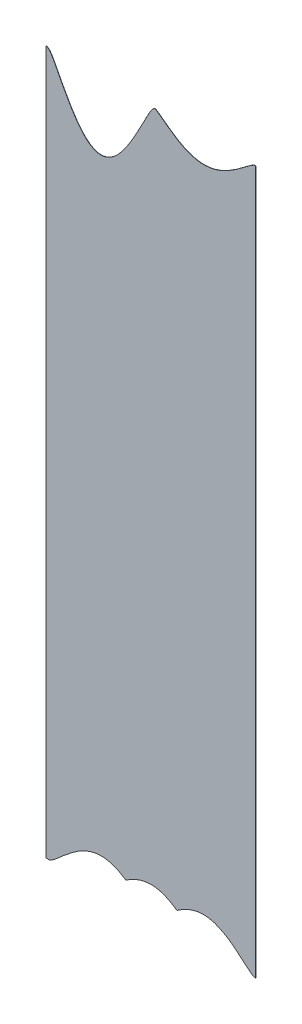
ISO-10303-21;
HEADER;
FILE_DESCRIPTION(('STEP AP214'),'2;1');
FILE_NAME('part.step','',(''),(''),'','','');
FILE_SCHEMA(('AUTOMOTIVE_DESIGN { 1 0 10303 214 1 1 1 1 }'));
ENDSEC;
DATA;
#1=APPLICATION_CONTEXT('core data for automotive mechanical design processes');
#2=APPLICATION_PROTOCOL_DEFINITION('international standard','automotive_design',2000,#1);
#3=PRODUCT_CONTEXT('',#1,'mechanical');
#4=PRODUCT('Part','Part','',(#3));
#5=PRODUCT_RELATED_PRODUCT_CATEGORY('part','',(#4));
#6=PRODUCT_DEFINITION_FORMATION('','',#4);
#7=PRODUCT_DEFINITION_CONTEXT('part definition',#1,'design');
#8=PRODUCT_DEFINITION('design','',#6,#7);
#9=PRODUCT_DEFINITION_SHAPE('','',#8);
#10=(LENGTH_UNIT() NAMED_UNIT(*) SI_UNIT(.MILLI.,.METRE.));
#11=(NAMED_UNIT(*) PLANE_ANGLE_UNIT() SI_UNIT($,.RADIAN.));
#12=(NAMED_UNIT(*) SI_UNIT($,.STERADIAN.) SOLID_ANGLE_UNIT());
#13=UNCERTAINTY_MEASURE_WITH_UNIT(LENGTH_MEASURE(1.E-05),#10,'distance_accuracy_value','');
#14=(GEOMETRIC_REPRESENTATION_CONTEXT(3) GLOBAL_UNCERTAINTY_ASSIGNED_CONTEXT((#13)) GLOBAL_UNIT_ASSIGNED_CONTEXT((#10,
#11,#12)) REPRESENTATION_CONTEXT('',''));
#15=CARTESIAN_POINT('',(0.,0.,0.));
#16=DIRECTION('',(0.,0.,1.));
#17=DIRECTION('',(1.,0.,0.));
#18=AXIS2_PLACEMENT_3D('',#15,#16,#17);
#19=CARTESIAN_POINT('',(77.4248337125186,269.090560042543,192.698226624831));
#20=CARTESIAN_POINT('',(77.209531905466,269.029841929501,192.699081003808));
#21=CARTESIAN_POINT('',(77.0031450020932,269.023383046287,192.699900005905));
#22=B_SPLINE_CURVE_WITH_KNOTS('',2,(#19,#20,#21),.UNSPECIFIED.,.F.,.F.,(3,3),(0.,1.),.UNSPECIFIED.);
#23=DIRECTION('',(-0.00396825396825352,0.,-0.999992126449225));
#24=VECTOR('',#23,1.);
#25=SURFACE_OF_LINEAR_EXTRUSION('',#22,#24);
#26=CARTESIAN_POINT('',(77.4244368871217,269.090560042543,192.598227412186));
#27=CARTESIAN_POINT('',(77.2091350800692,269.029841929501,192.599081791163));
#28=CARTESIAN_POINT('',(77.0027481766964,269.023383046287,192.59990079326));
#29=B_SPLINE_CURVE_WITH_KNOTS('',2,(#26,#27,#28),.UNSPECIFIED.,.F.,.F.,(3,3),(0.,1.),.UNSPECIFIED.);
#30=CARTESIAN_POINT('',(77.4244378112385,269.09055978193,192.598227408519));
#31=VERTEX_POINT('',#30);
#32=CARTESIAN_POINT('',(77.0027481766964,269.023383046287,192.59990079326));
#33=VERTEX_POINT('',#32);
#34=EDGE_CURVE('E212',#31,#33,#29,.T.);
#35=ORIENTED_EDGE('',*,*,#34,.F.);
#36=DIRECTION('',(-0.00396825396825352,0.,-0.999992126449225));
#37=VECTOR('',#36,1.);
#38=CARTESIAN_POINT('',(77.4248346366353,269.09055978193,192.698226621164));
#39=LINE('',#38,#37);
#40=CARTESIAN_POINT('',(77.4248346366353,269.09055978193,192.698226621164));
#41=VERTEX_POINT('',#40);
#42=EDGE_CURVE('E267',#41,#31,#39,.T.);
#43=ORIENTED_EDGE('',*,*,#42,.F.);
#44=CARTESIAN_POINT('',(77.0031450020932,269.023383046287,192.699900005905));
#45=VERTEX_POINT('',#44);
#46=EDGE_CURVE('E216',#41,#45,#22,.T.);
#47=ORIENTED_EDGE('',*,*,#46,.T.);
#48=DIRECTION('',(-0.00396825396825352,0.,-0.999992126449225));
#49=VECTOR('',#48,1.);
#50=CARTESIAN_POINT('',(77.0031450020932,269.023383046287,192.699900005905));
#51=LINE('',#50,#49);
#52=EDGE_CURVE('E13',#45,#33,#51,.T.);
#53=ORIENTED_EDGE('',*,*,#52,.T.);
#54=EDGE_LOOP('',(#35,#43,#47,#53));
#55=FACE_BOUND('',#54,.T.);
#56=ADVANCED_FACE('F45',(#55),#25,.T.);
#57=CARTESIAN_POINT('',(77.0031450020933,269.023383046284,192.699900005905));
#58=DIRECTION('',(0.999992126449225,0.,-0.00396825396825352));
#59=DIRECTION('',(0.00396825396825352,0.,0.999992126449225));
#60=AXIS2_PLACEMENT_3D('',#57,#58,#59);
#61=PLANE('',#60);
#62=DIRECTION('',(0.,1.,0.));
#63=VECTOR('',#62,1.);
#64=CARTESIAN_POINT('',(77.0027481766965,269.023383046284,192.59990079326));
#65=LINE('',#64,#63);
#66=CARTESIAN_POINT('',(77.0027481766964,536.798762383789,192.59990079326));
#67=VERTEX_POINT('',#66);
#68=EDGE_CURVE('E207',#33,#67,#65,.T.);
#69=ORIENTED_EDGE('',*,*,#68,.F.);
#70=ORIENTED_EDGE('',*,*,#52,.F.);
#71=DIRECTION('',(0.,1.,0.));
#72=VECTOR('',#71,1.);
#73=CARTESIAN_POINT('',(77.0031450020933,269.023383046284,192.699900005905));
#74=LINE('',#73,#72);
#75=CARTESIAN_POINT('',(77.0031450020932,536.798762383789,192.699900005905));
#76=VERTEX_POINT('',#75);
#77=EDGE_CURVE('E103',#45,#76,#74,.T.);
#78=ORIENTED_EDGE('',*,*,#77,.T.);
#79=DIRECTION('',(-0.00396825396825352,0.,-0.999992126449225));
#80=VECTOR('',#79,1.);
#81=CARTESIAN_POINT('',(77.0031450020932,536.798762383789,192.699900005905));
#82=LINE('',#81,#80);
#83=EDGE_CURVE('E54',#76,#67,#82,.T.);
#84=ORIENTED_EDGE('',*,*,#83,.T.);
#85=EDGE_LOOP('',(#69,#70,#78,#84));
#86=FACE_BOUND('',#85,.T.);
#87=ADVANCED_FACE('F197',(#86),#61,.F.);
#88=CARTESIAN_POINT('',(77.0031450020932,536.798762383789,192.699900005905));
#89=CARTESIAN_POINT('',(77.2661233072099,536.745601889857,192.698856432986));
#90=CARTESIAN_POINT('',(77.7241891403564,536.504886026703,192.697038697114));
#91=CARTESIAN_POINT('',(78.1225200868348,536.157177914668,192.695458006309));
#92=CARTESIAN_POINT('',(78.4699339120561,535.752648616193,192.694079369163));
#93=CARTESIAN_POINT('',(78.9033271113471,535.152786487229,192.692359541339));
#94=CARTESIAN_POINT('',(79.2170173776124,534.63292863615,192.691114728894));
#95=CARTESIAN_POINT('',(79.4561923109163,534.236560051497,192.690165614543));
#96=CARTESIAN_POINT('',(79.7442402813425,533.717596674628,192.689022558042));
#97=CARTESIAN_POINT('',(80.1428905244522,532.999366040864,192.687440600177));
#98=CARTESIAN_POINT('',(80.7402656251471,531.851921506764,192.685070045398));
#99=CARTESIAN_POINT('',(80.9454110452979,531.457875971932,192.684255969861));
#100=CARTESIAN_POINT('',(81.2253546543758,530.914886505265,192.683145073777));
#101=CARTESIAN_POINT('',(81.3511863839341,530.670818409025,192.682645737585));
#102=CARTESIAN_POINT('',(81.7074309720887,529.978334175992,192.681232057454));
#103=CARTESIAN_POINT('',(82.315394194015,528.796547955386,192.67881948599));
#104=CARTESIAN_POINT('',(82.6721967104483,528.110242036952,192.677403591841));
#105=CARTESIAN_POINT('',(83.1982487109191,527.098386501474,192.675316067466));
#106=CARTESIAN_POINT('',(83.6490694057289,526.25242367581,192.673527082369));
#107=CARTESIAN_POINT('',(84.7385225882531,524.208070115014,192.669203821415));
#108=CARTESIAN_POINT('',(85.6843286261529,522.57928036476,192.665450593301));
#109=CARTESIAN_POINT('',(86.8466121731742,520.577690765606,192.660838320688));
#110=CARTESIAN_POINT('',(87.9162297471326,518.985432515547,192.656593773086));
#111=CARTESIAN_POINT('',(89.2203980683777,517.044016424857,192.651418461222));
#112=CARTESIAN_POINT('',(90.4502154436802,515.615389030759,192.646538195117));
#113=CARTESIAN_POINT('',(91.1867844090042,514.759747678931,192.643615279384));
#114=CARTESIAN_POINT('',(91.9064459981967,514.07578364902,192.640759456941));
#115=CARTESIAN_POINT('',(92.735591316979,513.287766639173,192.637469171833));
#116=CARTESIAN_POINT('',(93.5491456678006,512.721153308884,192.634240756133));
#117=CARTESIAN_POINT('',(94.4904030548573,512.065599095202,192.630505578363));
#118=CARTESIAN_POINT('',(95.4190129942719,511.700757369727,192.626820589272));
#119=CARTESIAN_POINT('',(96.4704804987367,511.287646113508,192.622648066322));
#120=CARTESIAN_POINT('',(98.5755541764351,511.198598646507,192.614294533575));
#121=CARTESIAN_POINT('',(99.6392356365664,511.532507188992,192.610073542166));
#122=CARTESIAN_POINT('',(100.604163314002,511.8354151614,192.606244433932));
#123=CARTESIAN_POINT('',(101.580816687193,512.452586730697,192.602368794793));
#124=CARTESIAN_POINT('',(102.423018591509,512.984795071158,192.59902669743));
#125=CARTESIAN_POINT('',(103.280510134128,513.754779501639,192.595623926422));
#126=CARTESIAN_POINT('',(104.023955021638,514.422355751494,192.592673725068));
#127=CARTESIAN_POINT('',(104.784323840767,515.273514184056,192.589656364727));
#128=CARTESIAN_POINT('',(106.050228275655,516.690570232997,192.584632894877));
#129=CARTESIAN_POINT('',(107.391100121666,518.6506320657,192.579311932958));
#130=CARTESIAN_POINT('',(108.476670182567,520.237498438819,192.575004081338));
#131=CARTESIAN_POINT('',(109.653034416638,522.241955314544,192.570335932544));
#132=CARTESIAN_POINT('',(110.616669290892,523.883933618067,192.566511954522));
#133=CARTESIAN_POINT('',(111.718310313976,525.940076863676,192.56214032874));
#134=CARTESIAN_POINT('',(112.180237750085,526.802235187318,192.560307268926));
#135=CARTESIAN_POINT('',(112.710903316909,527.81988857811,192.558201436604));
#136=CARTESIAN_POINT('',(113.142966561622,528.648453032841,192.556486886419));
#137=CARTESIAN_POINT('',(113.93412269219,530.187170989474,192.553347353245));
#138=CARTESIAN_POINT('',(114.467358280453,531.222717301503,192.551231322345));
#139=CARTESIAN_POINT('',(114.666956735831,531.607438778925,192.550439258746));
#140=CARTESIAN_POINT('',(115.269967026661,532.769727382564,192.548046341926));
#141=CARTESIAN_POINT('',(115.665226981358,533.491221460733,192.546477837693));
#142=CARTESIAN_POINT('',(115.952331014527,534.015291398223,192.545338527003));
#143=CARTESIAN_POINT('',(116.189986174152,534.419245477904,192.544395443548));
#144=CARTESIAN_POINT('',(116.498677479085,534.943943162511,192.543170468407));
#145=CARTESIAN_POINT('',(116.919501763995,535.559437999124,192.54150051762));
#146=CARTESIAN_POINT('',(117.250759512005,535.980822727626,192.540185992397));
#147=CARTESIAN_POINT('',(117.625695647593,536.360192484867,192.538698138874));
#148=CARTESIAN_POINT('',(118.058114314527,536.655506954392,192.536982178273));
#149=CARTESIAN_POINT('',(118.304909703597,536.738353144728,192.53600282378));
#150=B_SPLINE_CURVE_WITH_KNOTS('',2,(#88,#89,#90,#91,#92,#93,#94,#95,#96,#97,#98,#99,#100,#101,
#102,#103,#104,#105,#106,#107,#108,#109,#110,#111,#112,#113,#114,#115,#116,#117,#118,#119,#120,
#121,#122,#123,#124,#125,#126,#127,#128,#129,#130,#131,#132,#133,#134,#135,#136,#137,#138,#139,
#140,#141,#142,#143,#144,#145,#146,#147,#148,#149),.UNSPECIFIED.,.F.,.F.,(3,1,1,1,1,2,2,2,2,2,2,
2,2,2,2,2,2,2,1,2,2,2,2,2,2,2,2,1,1,2,2,2,1,1,1,1,3),(0.,0.0078125,0.015625,0.0234375,0.03125,
0.046875,0.0625,0.09375,0.109375,0.125,0.15625,0.1875,0.25,0.3125,0.375,0.40625,0.4375,0.46875,
0.5,0.53125,0.5625,0.59375,0.625,0.6875,0.75,0.8125,0.84375,0.875,0.890625,0.90625,0.9375,
0.953125,0.96875,0.9765625,0.984375,0.9921875,1.),.UNSPECIFIED.);
#151=DIRECTION('',(-0.00396825396825352,0.,-0.999992126449225));
#152=VECTOR('',#151,1.);
#153=SURFACE_OF_LINEAR_EXTRUSION('',#150,#152);
#154=CARTESIAN_POINT('',(77.0027481766964,536.798762383789,192.59990079326));
#155=CARTESIAN_POINT('',(77.2657264818131,536.745601889857,192.598857220341));
#156=CARTESIAN_POINT('',(77.7237923149596,536.504886026703,192.597039484469));
#157=CARTESIAN_POINT('',(78.122123261438,536.157177914668,192.595458793664));
#158=CARTESIAN_POINT('',(78.4695370866593,535.752648616193,192.594080156519));
#159=CARTESIAN_POINT('',(78.9029302859503,535.152786487229,192.592360328694));
#160=CARTESIAN_POINT('',(79.2166205522156,534.63292863615,192.591115516249));
#161=CARTESIAN_POINT('',(79.4557954855195,534.236560051497,192.590166401898));
#162=CARTESIAN_POINT('',(79.7438434559457,533.717596674628,192.589023345397));
#163=CARTESIAN_POINT('',(80.1424936990554,532.999366040864,192.587441387532));
#164=CARTESIAN_POINT('',(80.7398687997503,531.851921506764,192.585070832753));
#165=CARTESIAN_POINT('',(80.9450142199011,531.457875971932,192.584256757216));
#166=CARTESIAN_POINT('',(81.224957828979,530.914886505265,192.583145861132));
#167=CARTESIAN_POINT('',(81.3507895585373,530.670818409025,192.58264652494));
#168=CARTESIAN_POINT('',(81.7070341466919,529.978334175992,192.581232844809));
#169=CARTESIAN_POINT('',(82.3149973686181,528.796547955386,192.578820273345));
#170=CARTESIAN_POINT('',(82.6717998850515,528.110242036952,192.577404379196));
#171=CARTESIAN_POINT('',(83.1978518855223,527.098386501474,192.575316854821));
#172=CARTESIAN_POINT('',(83.648672580332,526.25242367581,192.573527869724));
#173=CARTESIAN_POINT('',(84.7381257628563,524.208070115014,192.56920460877));
#174=CARTESIAN_POINT('',(85.6839318007561,522.57928036476,192.565451380656));
#175=CARTESIAN_POINT('',(86.8462153477774,520.577690765606,192.560839108043));
#176=CARTESIAN_POINT('',(87.9158329217358,518.985432515547,192.556594560441));
#177=CARTESIAN_POINT('',(89.2200012429809,517.044016424857,192.551419248577));
#178=CARTESIAN_POINT('',(90.4498186182834,515.615389030759,192.546538982472));
#179=CARTESIAN_POINT('',(91.1863875836074,514.759747678931,192.543616066739));
#180=CARTESIAN_POINT('',(91.9060491727999,514.07578364902,192.540760244296));
#181=CARTESIAN_POINT('',(92.7351944915822,513.287766639173,192.537469959188));
#182=CARTESIAN_POINT('',(93.5487488424038,512.721153308884,192.534241543488));
#183=CARTESIAN_POINT('',(94.4900062294605,512.065599095202,192.530506365718));
#184=CARTESIAN_POINT('',(95.418616168875,511.700757369727,192.526821376627));
#185=CARTESIAN_POINT('',(96.4700836733399,511.287646113508,192.522648853677));
#186=CARTESIAN_POINT('',(98.5751573510383,511.198598646507,192.51429532093));
#187=CARTESIAN_POINT('',(99.6388388111695,511.532507188992,192.510074329521));
#188=CARTESIAN_POINT('',(100.603766488605,511.8354151614,192.506245221287));
#189=CARTESIAN_POINT('',(101.580419861796,512.452586730697,192.502369582148));
#190=CARTESIAN_POINT('',(102.422621766113,512.984795071158,192.499027484785));
#191=CARTESIAN_POINT('',(103.280113308731,513.754779501639,192.495624713777));
#192=CARTESIAN_POINT('',(104.023558196241,514.422355751494,192.492674512423));
#193=CARTESIAN_POINT('',(104.783927015371,515.273514184056,192.489657152082));
#194=CARTESIAN_POINT('',(106.049831450258,516.690570232997,192.484633682232));
#195=CARTESIAN_POINT('',(107.390703296269,518.6506320657,192.479312720314));
#196=CARTESIAN_POINT('',(108.47627335717,520.237498438819,192.475004868693));
#197=CARTESIAN_POINT('',(109.652637591242,522.241955314544,192.470336719899));
#198=CARTESIAN_POINT('',(110.616272465495,523.883933618067,192.466512741877));
#199=CARTESIAN_POINT('',(111.717913488579,525.940076863676,192.462141116095));
#200=CARTESIAN_POINT('',(112.179840924688,526.802235187318,192.460308056281));
#201=CARTESIAN_POINT('',(112.710506491512,527.81988857811,192.458202223959));
#202=CARTESIAN_POINT('',(113.142569736225,528.648453032841,192.456487673774));
#203=CARTESIAN_POINT('',(113.933725866793,530.187170989474,192.4533481406));
#204=CARTESIAN_POINT('',(114.466961455056,531.222717301503,192.4512321097));
#205=CARTESIAN_POINT('',(114.666559910434,531.607438778925,192.450440046101));
#206=CARTESIAN_POINT('',(115.269570201264,532.769727382564,192.448047129281));
#207=CARTESIAN_POINT('',(115.664830155962,533.491221460733,192.446478625048));
#208=CARTESIAN_POINT('',(115.95193418913,534.015291398223,192.445339314358));
#209=CARTESIAN_POINT('',(116.189589348755,534.419245477904,192.444396230903));
#210=CARTESIAN_POINT('',(116.498280653688,534.943943162511,192.443171255762));
#211=CARTESIAN_POINT('',(116.919104938598,535.559437999124,192.441501304975));
#212=CARTESIAN_POINT('',(117.250362686608,535.980822727626,192.440186779752));
#213=CARTESIAN_POINT('',(117.625298822197,536.360192484867,192.43869892623));
#214=CARTESIAN_POINT('',(118.05771748913,536.655506954392,192.436982965628));
#215=CARTESIAN_POINT('',(118.304512878201,536.738353144728,192.436003611135));
#216=B_SPLINE_CURVE_WITH_KNOTS('',2,(#154,#155,#156,#157,#158,#159,#160,#161,#162,#163,#164,
#165,#166,#167,#168,#169,#170,#171,#172,#173,#174,#175,#176,#177,#178,#179,#180,#181,#182,#183,
#184,#185,#186,#187,#188,#189,#190,#191,#192,#193,#194,#195,#196,#197,#198,#199,#200,#201,#202,
#203,#204,#205,#206,#207,#208,#209,#210,#211,#212,#213,#214,#215),.UNSPECIFIED.,.F.,.F.,(3,1,1,
1,1,2,2,2,2,2,2,2,2,2,2,2,2,2,1,2,2,2,2,2,2,2,2,1,1,2,2,2,1,1,1,1,3),(0.,0.0078125,0.015625,
0.0234375,0.03125,0.046875,0.0625,0.09375,0.109375,0.125,0.15625,0.1875,0.25,0.3125,0.375,
0.40625,0.4375,0.46875,0.5,0.53125,0.5625,0.59375,0.625,0.6875,0.75,0.8125,0.84375,0.875,
0.890625,0.90625,0.9375,0.953125,0.96875,0.9765625,0.984375,0.9921875,1.),.UNSPECIFIED.);
#217=CARTESIAN_POINT('',(118.304512227476,536.738352926288,192.436003613717));
#218=VERTEX_POINT('',#217);
#219=EDGE_CURVE('E211',#67,#218,#216,.T.);
#220=ORIENTED_EDGE('',*,*,#219,.F.);
#221=ORIENTED_EDGE('',*,*,#83,.F.);
#222=CARTESIAN_POINT('',(118.304909052873,536.738352926288,192.536002826362));
#223=VERTEX_POINT('',#222);
#224=EDGE_CURVE('E183',#76,#223,#150,.T.);
#225=ORIENTED_EDGE('',*,*,#224,.T.);
#226=DIRECTION('',(-0.00396825396825352,0.,-0.999992126449225));
#227=VECTOR('',#226,1.);
#228=CARTESIAN_POINT('',(118.304909052873,536.738352926288,192.536002826362));
#229=LINE('',#228,#227);
#230=EDGE_CURVE('E280',#223,#218,#229,.T.);
#231=ORIENTED_EDGE('',*,*,#230,.T.);
#232=EDGE_LOOP('',(#220,#221,#225,#231));
#233=FACE_BOUND('',#232,.T.);
#234=ADVANCED_FACE('F195',(#233),#153,.T.);
#235=CARTESIAN_POINT('',(156.045391688402,536.841373071262,192.386237827197));
#236=CARTESIAN_POINT('',(155.765318183027,536.765069028169,192.387349238747));
#237=CARTESIAN_POINT('',(155.162845070259,536.45254159597,192.389740023892));
#238=CARTESIAN_POINT('',(154.592723782437,536.087646645492,192.392002427768));
#239=CARTESIAN_POINT('',(154.043168794489,535.702031737504,192.3941832187));
#240=CARTESIAN_POINT('',(153.742388790449,535.48127210741,192.395376799542));
#241=CARTESIAN_POINT('',(153.363029615969,535.202838734493,192.396882204945));
#242=CARTESIAN_POINT('',(152.667189238269,534.676581587643,192.399643498026));
#243=CARTESIAN_POINT('',(152.400469058819,534.474863772548,192.40070191977));
#244=CARTESIAN_POINT('',(151.877971267864,534.079400683924,192.402775340028));
#245=CARTESIAN_POINT('',(151.015669372125,533.431841613234,192.406197199889));
#246=CARTESIAN_POINT('',(150.532856942733,533.078983689833,192.408113137313));
#247=CARTESIAN_POINT('',(149.966096694572,532.664773466447,192.410362203625));
#248=CARTESIAN_POINT('',(149.45059751703,532.30372294149,192.412407851389));
#249=CARTESIAN_POINT('',(148.272729765341,531.478756018936,192.41708196657));
#250=CARTESIAN_POINT('',(147.212872165682,530.827567207667,192.421287783811));
#251=CARTESIAN_POINT('',(146.01156910529,530.089472663528,192.426054896981));
#252=CARTESIAN_POINT('',(144.88435801285,529.525768207979,192.430527992091));
#253=CARTESIAN_POINT('',(143.626709731363,528.896833712441,192.435518699169));
#254=CARTESIAN_POINT('',(142.420935821994,528.464376655478,192.440303553944));
#255=CARTESIAN_POINT('',(141.112159771375,527.994977347135,192.445497150592));
#256=CARTESIAN_POINT('',(138.504260625672,527.487500402413,192.455846038209));
#257=CARTESIAN_POINT('',(135.851481006829,527.441430089682,192.466373024343));
#258=CARTESIAN_POINT('',(133.219579285513,527.868929585031,192.476817161025));
#259=CARTESIAN_POINT('',(131.900910231581,528.304899972493,192.482050015932));
#260=CARTESIAN_POINT('',(130.679733165645,528.708638148502,192.486895994825));
#261=CARTESIAN_POINT('',(129.410836751034,529.314389088708,192.491931337704));
#262=CARTESIAN_POINT('',(128.270639403012,529.858701144152,192.496455965979));
#263=CARTESIAN_POINT('',(127.062193393948,530.580591386184,192.501251424407));
#264=CARTESIAN_POINT('',(125.988191244157,531.222168805481,192.505513371257));
#265=CARTESIAN_POINT('',(124.810001959099,532.034772517837,192.510188762375));
#266=CARTESIAN_POINT('',(124.287629959298,532.395055395685,192.512261683457));
#267=CARTESIAN_POINT('',(123.223529637176,533.165422377477,192.51648433703));
#268=CARTESIAN_POINT('',(122.653741053082,533.592277361559,192.518745420643));
#269=CARTESIAN_POINT('',(122.214644552296,533.921224860834,192.520487880794));
#270=CARTESIAN_POINT('',(121.320530177807,534.603020667313,192.524035981645));
#271=CARTESIAN_POINT('',(120.77134582513,535.022466343055,192.52621530179));
#272=CARTESIAN_POINT('',(120.518362806926,535.213935971388,192.527219210561));
#273=CARTESIAN_POINT('',(119.858655358954,535.713234069612,192.529837117871));
#274=CARTESIAN_POINT('',(119.436746188699,536.012901321695,192.531511373793));
#275=CARTESIAN_POINT('',(119.130950273405,536.230097410558,192.532724859201));
#276=CARTESIAN_POINT('',(118.562920844534,536.600017899544,192.534978961984));
#277=CARTESIAN_POINT('',(118.304909703597,536.738353144728,192.53600282378));
#278=B_SPLINE_CURVE_WITH_KNOTS('',2,(#235,#236,#237,#238,#239,#240,#241,#242,#243,#244,#245,
#246,#247,#248,#249,#250,#251,#252,#253,#254,#255,#256,#257,#258,#259,#260,#261,#262,#263,#264,
#265,#266,#267,#268,#269,#270,#271,#272,#273,#274,#275,#276,#277),.UNSPECIFIED.,.F.,.F.,(3,1,1,
1,2,2,1,1,2,2,2,2,2,1,1,1,2,2,2,2,1,2,1,1,2,2,1,3),(0.,0.015625,0.03125,0.046875,0.0625,0.09375,
0.109375,0.125,0.15625,0.1875,0.25,0.3125,0.375,0.4375,0.5,0.5625,0.625,0.6875,0.75,0.8125,
0.84375,0.875,0.90625,0.921875,0.9375,0.96875,0.984375,1.),.UNSPECIFIED.);
#279=DIRECTION('',(-0.00396825396825352,0.,-0.999992126449225));
#280=VECTOR('',#279,1.);
#281=SURFACE_OF_LINEAR_EXTRUSION('',#278,#280);
#282=CARTESIAN_POINT('',(156.044994863005,536.841373071262,192.286238614552));
#283=CARTESIAN_POINT('',(155.764921357631,536.765069028169,192.287350026102));
#284=CARTESIAN_POINT('',(155.162448244862,536.45254159597,192.289740811247));
#285=CARTESIAN_POINT('',(154.59232695704,536.087646645492,192.292003215123));
#286=CARTESIAN_POINT('',(154.042771969092,535.702031737504,192.294184006055));
#287=CARTESIAN_POINT('',(153.741991965052,535.48127210741,192.295377586897));
#288=CARTESIAN_POINT('',(153.362632790572,535.202838734493,192.2968829923));
#289=CARTESIAN_POINT('',(152.666792412872,534.676581587643,192.299644285381));
#290=CARTESIAN_POINT('',(152.400072233422,534.474863772548,192.300702707125));
#291=CARTESIAN_POINT('',(151.877574442467,534.079400683924,192.302776127383));
#292=CARTESIAN_POINT('',(151.015272546728,533.431841613234,192.306197987244));
#293=CARTESIAN_POINT('',(150.532460117336,533.078983689833,192.308113924668));
#294=CARTESIAN_POINT('',(149.965699869175,532.664773466447,192.31036299098));
#295=CARTESIAN_POINT('',(149.450200691633,532.30372294149,192.312408638744));
#296=CARTESIAN_POINT('',(148.272332939944,531.478756018936,192.317082753925));
#297=CARTESIAN_POINT('',(147.212475340285,530.827567207667,192.321288571166));
#298=CARTESIAN_POINT('',(146.011172279893,530.089472663528,192.326055684336));
#299=CARTESIAN_POINT('',(144.883961187453,529.525768207979,192.330528779446));
#300=CARTESIAN_POINT('',(143.626312905966,528.896833712441,192.335519486524));
#301=CARTESIAN_POINT('',(142.420538996597,528.464376655478,192.340304341299));
#302=CARTESIAN_POINT('',(141.111762945978,527.994977347135,192.345497937947));
#303=CARTESIAN_POINT('',(138.503863800275,527.487500402413,192.355846825564));
#304=CARTESIAN_POINT('',(135.851084181432,527.441430089682,192.366373811698));
#305=CARTESIAN_POINT('',(133.219182460116,527.868929585031,192.37681794838));
#306=CARTESIAN_POINT('',(131.900513406184,528.304899972493,192.382050803287));
#307=CARTESIAN_POINT('',(130.679336340248,528.708638148502,192.38689678218));
#308=CARTESIAN_POINT('',(129.410439925637,529.314389088708,192.391932125059));
#309=CARTESIAN_POINT('',(128.270242577615,529.858701144152,192.396456753334));
#310=CARTESIAN_POINT('',(127.061796568551,530.580591386184,192.401252211763));
#311=CARTESIAN_POINT('',(125.98779441876,531.222168805481,192.405514158612));
#312=CARTESIAN_POINT('',(124.809605133703,532.034772517837,192.41018954973));
#313=CARTESIAN_POINT('',(124.287233133901,532.395055395685,192.412262470812));
#314=CARTESIAN_POINT('',(123.223132811779,533.165422377477,192.416485124385));
#315=CARTESIAN_POINT('',(122.653344227685,533.592277361559,192.418746207998));
#316=CARTESIAN_POINT('',(122.214247726899,533.921224860834,192.420488668149));
#317=CARTESIAN_POINT('',(121.32013335241,534.603020667313,192.424036769));
#318=CARTESIAN_POINT('',(120.770948999733,535.022466343055,192.426216089145));
#319=CARTESIAN_POINT('',(120.517965981529,535.213935971388,192.427219997916));
#320=CARTESIAN_POINT('',(119.858258533557,535.713234069612,192.429837905226));
#321=CARTESIAN_POINT('',(119.436349363303,536.012901321695,192.431512161148));
#322=CARTESIAN_POINT('',(119.130553448008,536.230097410558,192.432725646556));
#323=CARTESIAN_POINT('',(118.562524019137,536.600017899544,192.434979749339));
#324=CARTESIAN_POINT('',(118.3045128782,536.738353144728,192.436003611135));
#325=B_SPLINE_CURVE_WITH_KNOTS('',2,(#282,#283,#284,#285,#286,#287,#288,#289,#290,#291,#292,
#293,#294,#295,#296,#297,#298,#299,#300,#301,#302,#303,#304,#305,#306,#307,#308,#309,#310,#311,
#312,#313,#314,#315,#316,#317,#318,#319,#320,#321,#322,#323,#324),.UNSPECIFIED.,.F.,.F.,(3,1,1,
1,2,2,1,1,2,2,2,2,2,1,1,1,2,2,2,2,1,2,1,1,2,2,1,3),(0.,0.015625,0.03125,0.046875,0.0625,0.09375,
0.109375,0.125,0.15625,0.1875,0.25,0.3125,0.375,0.4375,0.5,0.5625,0.625,0.6875,0.75,0.8125,
0.84375,0.875,0.90625,0.921875,0.9375,0.96875,0.984375,1.),.UNSPECIFIED.);
#326=CARTESIAN_POINT('',(156.044993414352,536.841372676586,192.286238620301));
#327=VERTEX_POINT('',#326);
#328=EDGE_CURVE('E231',#327,#218,#325,.T.);
#329=ORIENTED_EDGE('',*,*,#328,.T.);
#330=ORIENTED_EDGE('',*,*,#230,.F.);
#331=CARTESIAN_POINT('',(156.045390239749,536.841372676586,192.386237832946));
#332=VERTEX_POINT('',#331);
#333=EDGE_CURVE('E175',#332,#223,#278,.T.);
#334=ORIENTED_EDGE('',*,*,#333,.F.);
#335=DIRECTION('',(-0.00396825396825352,0.,-0.999992126449225));
#336=VECTOR('',#335,1.);
#337=CARTESIAN_POINT('',(156.045390239749,536.841372676586,192.386237832946));
#338=LINE('',#337,#336);
#339=EDGE_CURVE('E277',#332,#327,#338,.T.);
#340=ORIENTED_EDGE('',*,*,#339,.T.);
#341=EDGE_LOOP('',(#329,#330,#334,#340));
#342=FACE_BOUND('',#341,.T.);
#343=ADVANCED_FACE('F167',(#342),#281,.F.);
#344=CARTESIAN_POINT('',(156.045391688397,536.841373071261,192.386237827197));
#345=CARTESIAN_POINT('',(156.223575255245,536.84054643345,192.385530743984));
#346=CARTESIAN_POINT('',(156.384417031628,536.816407153966,192.384892477941));
#347=B_SPLINE_CURVE_WITH_KNOTS('',2,(#344,#345,#346),.UNSPECIFIED.,.F.,.F.,(3,3),(0.,1.),.UNSPECIFIED.);
#348=DIRECTION('',(-0.00396825396825352,0.,-0.999992126449225));
#349=VECTOR('',#348,1.);
#350=SURFACE_OF_LINEAR_EXTRUSION('',#347,#349);
#351=CARTESIAN_POINT('',(156.044994863001,536.841373071261,192.286238614553));
#352=CARTESIAN_POINT('',(156.223178429848,536.84054643345,192.285531531339));
#353=CARTESIAN_POINT('',(156.384020206231,536.816407153966,192.284893265296));
#354=B_SPLINE_CURVE_WITH_KNOTS('',2,(#351,#352,#353),.UNSPECIFIED.,.F.,.F.,(3,3),(0.,1.),.UNSPECIFIED.);
#355=CARTESIAN_POINT('',(156.384020206231,536.816407153966,192.284893265296));
#356=VERTEX_POINT('',#355);
#357=EDGE_CURVE('E238',#327,#356,#354,.T.);
#358=ORIENTED_EDGE('',*,*,#357,.F.);
#359=ORIENTED_EDGE('',*,*,#339,.F.);
#360=CARTESIAN_POINT('',(156.384417031628,536.816407153966,192.384892477941));
#361=VERTEX_POINT('',#360);
#362=EDGE_CURVE('E142',#332,#361,#347,.T.);
#363=ORIENTED_EDGE('',*,*,#362,.T.);
#364=DIRECTION('',(-0.00396825396825352,0.,-0.999992126449225));
#365=VECTOR('',#364,1.);
#366=CARTESIAN_POINT('',(156.384417031628,536.816407153966,192.384892477941));
#367=LINE('',#366,#365);
#368=EDGE_CURVE('E274',#361,#356,#367,.T.);
#369=ORIENTED_EDGE('',*,*,#368,.T.);
#370=EDGE_LOOP('',(#358,#359,#363,#369));
#371=FACE_BOUND('',#370,.T.);
#372=ADVANCED_FACE('F163',(#371),#350,.T.);
#373=CARTESIAN_POINT('',(156.384417031628,269.023383046284,192.384892477941));
#374=DIRECTION('',(0.999992126449225,0.,-0.00396825396825352));
#375=DIRECTION('',(0.00396825396825352,0.,0.999992126449225));
#376=AXIS2_PLACEMENT_3D('',#373,#374,#375);
#377=PLANE('',#376);
#378=DIRECTION('',(0.,1.,0.));
#379=VECTOR('',#378,1.);
#380=CARTESIAN_POINT('',(156.384020206231,269.023383046284,192.284893265296));
#381=LINE('',#380,#379);
#382=CARTESIAN_POINT('',(156.384020206231,269.023383046284,192.284893265296));
#383=VERTEX_POINT('',#382);
#384=EDGE_CURVE('E246',#383,#356,#381,.T.);
#385=ORIENTED_EDGE('',*,*,#384,.T.);
#386=ORIENTED_EDGE('',*,*,#368,.F.);
#387=DIRECTION('',(0.,1.,0.));
#388=VECTOR('',#387,1.);
#389=CARTESIAN_POINT('',(156.384417031628,269.023383046284,192.384892477941));
#390=LINE('',#389,#388);
#391=CARTESIAN_POINT('',(156.384417031628,269.023383046284,192.384892477941));
#392=VERTEX_POINT('',#391);
#393=EDGE_CURVE('E140',#392,#361,#390,.T.);
#394=ORIENTED_EDGE('',*,*,#393,.F.);
#395=DIRECTION('',(-0.00396825396825352,0.,-0.999992126449225));
#396=VECTOR('',#395,1.);
#397=CARTESIAN_POINT('',(156.384417031628,269.023383046284,192.384892477941));
#398=LINE('',#397,#396);
#399=EDGE_CURVE('E134',#392,#383,#398,.T.);
#400=ORIENTED_EDGE('',*,*,#399,.T.);
#401=EDGE_LOOP('',(#385,#386,#394,#400));
#402=FACE_BOUND('',#401,.T.);
#403=ADVANCED_FACE('F159',(#402),#377,.T.);
#404=CARTESIAN_POINT('',(156.384417031628,269.023383046284,192.384892477941));
#405=CARTESIAN_POINT('',(156.130400584763,269.031332497231,192.385900487651));
#406=CARTESIAN_POINT('',(155.631720711285,269.199229942738,192.387879391619));
#407=CARTESIAN_POINT('',(155.162969614565,269.456682052673,192.389739529664));
#408=CARTESIAN_POINT('',(154.720587782007,269.757282209135,192.391495026949));
#409=CARTESIAN_POINT('',(154.13535920463,270.201876704061,192.393817380859));
#410=CARTESIAN_POINT('',(153.661459781603,270.600341961366,192.395697948931));
#411=CARTESIAN_POINT('',(153.329984405857,270.879053887293,192.397013337763));
#412=CARTESIAN_POINT('',(152.859594889327,271.288957804515,192.398879977526));
#413=CARTESIAN_POINT('',(152.630576716892,271.488527400983,192.399788786953));
#414=CARTESIAN_POINT('',(151.565658776265,272.423710471797,192.40401468507));
#415=CARTESIAN_POINT('',(151.272264826594,272.679327866259,192.405178955942));
#416=CARTESIAN_POINT('',(150.371187212322,273.464385336689,192.408754688914));
#417=CARTESIAN_POINT('',(149.659096607114,274.056490898607,192.411580467533));
#418=CARTESIAN_POINT('',(148.792068078922,274.77742782732,192.41502108402));
#419=CARTESIAN_POINT('',(148.009175404546,275.378154997483,192.418127825443));
#420=CARTESIAN_POINT('',(147.131722174416,276.051440127282,192.421609810121));
#421=CARTESIAN_POINT('',(146.308625387055,276.613720874679,192.424876092931));
#422=CARTESIAN_POINT('',(145.391070312093,277.240528755901,192.428517213167));
#423=CARTESIAN_POINT('',(143.5563170636,278.302153749017,192.435798037352));
#424=CARTESIAN_POINT('',(141.623114605392,279.181609643846,192.44346953608));
#425=CARTESIAN_POINT('',(139.599791893899,279.814231782025,192.451498657677));
#426=CARTESIAN_POINT('',(137.509590293649,280.140948150294,192.459793173779));
#427=CARTESIAN_POINT('',(135.392621029365,280.122052813568,192.468193911606));
#428=CARTESIAN_POINT('',(133.306064795959,279.759776953696,192.476473961853));
#429=CARTESIAN_POINT('',(131.290423028272,279.096716403234,192.484472603273));
#430=CARTESIAN_POINT('',(129.36928565714,278.195202609465,192.492096224295));
#431=CARTESIAN_POINT('',(127.544095926949,277.116907747343,192.499339097712));
#432=CARTESIAN_POINT('',(126.628989557853,276.482414355155,192.502970500784));
#433=B_SPLINE_CURVE_WITH_KNOTS('',2,(#404,#405,#406,#407,#408,#409,#410,#411,#412,#413,#414,
#415,#416,#417,#418,#419,#420,#421,#422,#423,#424,#425,#426,#427,#428,#429,#430,#431,#432),
.UNSPECIFIED.,.F.,.F.,(3,1,1,1,1,2,2,1,2,2,2,2,1,1,1,1,1,1,1,1,1,3),(0.,0.015625,0.03125,
0.046875,0.0625,0.09375,0.125,0.15625,0.1875,0.25,0.3125,0.375,0.4375,0.5,0.5625,0.625,0.6875,
0.75,0.8125,0.875,0.9375,1.),.UNSPECIFIED.);
#434=DIRECTION('',(-0.00396825396825352,0.,-0.999992126449225));
#435=VECTOR('',#434,1.);
#436=SURFACE_OF_LINEAR_EXTRUSION('',#433,#435);
#437=CARTESIAN_POINT('',(156.384020206231,269.023383046284,192.284893265296));
#438=CARTESIAN_POINT('',(156.130003759366,269.031332497231,192.285901275006));
#439=CARTESIAN_POINT('',(155.631323885888,269.199229942738,192.287880178974));
#440=CARTESIAN_POINT('',(155.162572789168,269.456682052673,192.289740317019));
#441=CARTESIAN_POINT('',(154.72019095661,269.757282209135,192.291495814304));
#442=CARTESIAN_POINT('',(154.134962379233,270.201876704061,192.293818168214));
#443=CARTESIAN_POINT('',(153.661062956206,270.600341961366,192.295698736286));
#444=CARTESIAN_POINT('',(153.32958758046,270.879053887293,192.297014125118));
#445=CARTESIAN_POINT('',(152.85919806393,271.288957804515,192.298880764881));
#446=CARTESIAN_POINT('',(152.630179891495,271.488527400983,192.299789574308));
#447=CARTESIAN_POINT('',(151.565261950868,272.423710471797,192.304015472425));
#448=CARTESIAN_POINT('',(151.271868001198,272.679327866259,192.305179743297));
#449=CARTESIAN_POINT('',(150.370790386925,273.464385336689,192.308755476269));
#450=CARTESIAN_POINT('',(149.658699781717,274.056490898607,192.311581254888));
#451=CARTESIAN_POINT('',(148.791671253525,274.77742782732,192.315021871375));
#452=CARTESIAN_POINT('',(148.008778579149,275.378154997483,192.318128612798));
#453=CARTESIAN_POINT('',(147.131325349019,276.051440127282,192.321610597476));
#454=CARTESIAN_POINT('',(146.308228561658,276.613720874679,192.324876880286));
#455=CARTESIAN_POINT('',(145.390673486696,277.240528755901,192.328518000522));
#456=CARTESIAN_POINT('',(143.555920238204,278.302153749017,192.335798824707));
#457=CARTESIAN_POINT('',(141.622717779995,279.181609643846,192.343470323435));
#458=CARTESIAN_POINT('',(139.599395068502,279.814231782025,192.351499445032));
#459=CARTESIAN_POINT('',(137.509193468252,280.140948150294,192.359793961134));
#460=CARTESIAN_POINT('',(135.392224203968,280.122052813568,192.368194698961));
#461=CARTESIAN_POINT('',(133.305667970562,279.759776953696,192.376474749208));
#462=CARTESIAN_POINT('',(131.290026202875,279.096716403234,192.384473390629));
#463=CARTESIAN_POINT('',(129.368888831743,278.195202609465,192.39209701165));
#464=CARTESIAN_POINT('',(127.543699101552,277.116907747343,192.399339885067));
#465=CARTESIAN_POINT('',(126.628592732457,276.482414355155,192.402971288139));
#466=B_SPLINE_CURVE_WITH_KNOTS('',2,(#437,#438,#439,#440,#441,#442,#443,#444,#445,#446,#447,
#448,#449,#450,#451,#452,#453,#454,#455,#456,#457,#458,#459,#460,#461,#462,#463,#464,#465),
.UNSPECIFIED.,.F.,.F.,(3,1,1,1,1,2,2,1,2,2,2,2,1,1,1,1,1,1,1,1,1,3),(0.,0.015625,0.03125,
0.046875,0.0625,0.09375,0.125,0.15625,0.1875,0.25,0.3125,0.375,0.4375,0.5,0.5625,0.625,0.6875,
0.75,0.8125,0.875,0.9375,1.),.UNSPECIFIED.);
#467=CARTESIAN_POINT('',(126.62859317292,276.482414660553,192.402971286392));
#468=VERTEX_POINT('',#467);
#469=EDGE_CURVE('E251',#383,#468,#466,.T.);
#470=ORIENTED_EDGE('',*,*,#469,.F.);
#471=ORIENTED_EDGE('',*,*,#399,.F.);
#472=CARTESIAN_POINT('',(126.628989998317,276.482414660553,192.502970499036));
#473=VERTEX_POINT('',#472);
#474=EDGE_CURVE('E124',#392,#473,#433,.T.);
#475=ORIENTED_EDGE('',*,*,#474,.T.);
#476=DIRECTION('',(-0.00396825396825352,0.,-0.999992126449225));
#477=VECTOR('',#476,1.);
#478=CARTESIAN_POINT('',(126.628989998317,276.482414660553,192.502970499036));
#479=LINE('',#478,#477);
#480=EDGE_CURVE('E129',#473,#468,#479,.T.);
#481=ORIENTED_EDGE('',*,*,#480,.T.);
#482=EDGE_LOOP('',(#470,#471,#475,#481));
#483=FACE_BOUND('',#482,.T.);
#484=ADVANCED_FACE('F137',(#483),#436,.T.);
#485=CARTESIAN_POINT('',(126.628989557853,276.482414355155,192.502970500784));
#486=CARTESIAN_POINT('',(125.551184443788,277.229715702884,192.507247538881));
#487=CARTESIAN_POINT('',(124.475933292209,277.844229941681,192.511514442126));
#488=CARTESIAN_POINT('',(124.362329287785,277.908384550727,192.511965255216));
#489=CARTESIAN_POINT('',(123.221540546996,278.543921080315,192.516492230307));
#490=CARTESIAN_POINT('',(122.122679361486,278.999337700112,192.520852824901));
#491=CARTESIAN_POINT('',(122.004784227885,279.047280378897,192.521320666416));
#492=CARTESIAN_POINT('',(120.743507153194,279.548574121383,192.526325773581));
#493=CARTESIAN_POINT('',(118.277108365908,280.098709783935,192.536113147417));
#494=CARTESIAN_POINT('',(115.688834933328,280.158762026427,192.546384154606));
#495=CARTESIAN_POINT('',(113.191914578526,279.709940163813,192.556292646727));
#496=CARTESIAN_POINT('',(111.914402062401,279.251006088666,192.561362180754));
#497=CARTESIAN_POINT('',(111.79184732321,279.2058188981,192.561848512914));
#498=CARTESIAN_POINT('',(110.671855496913,278.783352197265,192.566292959916));
#499=CARTESIAN_POINT('',(109.51868364585,278.177395794037,192.570869074721));
#500=CARTESIAN_POINT('',(109.406616389533,278.117662173993,192.571313789557));
#501=CARTESIAN_POINT('',(108.31744783861,277.529411150007,192.575635921011));
#502=CARTESIAN_POINT('',(107.230459335498,276.803596840149,192.579949401415));
#503=B_SPLINE_CURVE_WITH_KNOTS('',2,(#485,#486,#487,#488,#489,#490,#491,#492,#493,#494,#495,
#496,#497,#498,#499,#500,#501,#502),.UNSPECIFIED.,.F.,.F.,(3,1,1,1,1,1,1,1,1,1,1,1,1,1,1,1,3),
(0.,0.11875,0.125,0.13125,0.2440625,0.25,0.25625,0.375,0.5,0.625,0.74375,0.75,0.75625,0.8690625,
0.875,0.88125,1.),.UNSPECIFIED.);
#504=DIRECTION('',(-0.00396825396825352,0.,-0.999992126449225));
#505=VECTOR('',#504,1.);
#506=SURFACE_OF_LINEAR_EXTRUSION('',#503,#505);
#507=CARTESIAN_POINT('',(126.628592732457,276.482414355155,192.402971288139));
#508=CARTESIAN_POINT('',(125.550787618391,277.229715702884,192.407248326236));
#509=CARTESIAN_POINT('',(124.475536466812,277.844229941681,192.411515229481));
#510=CARTESIAN_POINT('',(124.361932462388,277.908384550727,192.411966042571));
#511=CARTESIAN_POINT('',(123.221143721599,278.543921080315,192.416493017662));
#512=CARTESIAN_POINT('',(122.122282536089,278.999337700112,192.420853612256));
#513=CARTESIAN_POINT('',(122.004387402488,279.047280378897,192.421321453771));
#514=CARTESIAN_POINT('',(120.743110327797,279.548574121383,192.426326560936));
#515=CARTESIAN_POINT('',(118.276711540511,280.098709783935,192.436113934772));
#516=CARTESIAN_POINT('',(115.688438107931,280.158762026427,192.446384941961));
#517=CARTESIAN_POINT('',(113.191517753129,279.709940163813,192.456293434082));
#518=CARTESIAN_POINT('',(111.914005237004,279.251006088666,192.461362968109));
#519=CARTESIAN_POINT('',(111.791450497813,279.2058188981,192.461849300269));
#520=CARTESIAN_POINT('',(110.671458671517,278.783352197265,192.466293747271));
#521=CARTESIAN_POINT('',(109.518286820453,278.177395794037,192.470869862076));
#522=CARTESIAN_POINT('',(109.406219564136,278.117662173993,192.471314576912));
#523=CARTESIAN_POINT('',(108.317051013213,277.529411150007,192.475636708366));
#524=CARTESIAN_POINT('',(107.230062510101,276.803596840149,192.47995018877));
#525=B_SPLINE_CURVE_WITH_KNOTS('',2,(#507,#508,#509,#510,#511,#512,#513,#514,#515,#516,#517,
#518,#519,#520,#521,#522,#523,#524),.UNSPECIFIED.,.F.,.F.,(3,1,1,1,1,1,1,1,1,1,1,1,1,1,1,1,3),
(0.,0.11875,0.125,0.13125,0.2440625,0.25,0.25625,0.375,0.5,0.625,0.74375,0.75,0.75625,0.8690625,
0.875,0.88125,1.),.UNSPECIFIED.);
#526=CARTESIAN_POINT('',(107.230062960297,276.803597140759,192.479950186983));
#527=VERTEX_POINT('',#526);
#528=EDGE_CURVE('E131',#468,#527,#525,.T.);
#529=ORIENTED_EDGE('',*,*,#528,.F.);
#530=ORIENTED_EDGE('',*,*,#480,.F.);
#531=CARTESIAN_POINT('',(107.230459785694,276.803597140759,192.579949399628));
#532=VERTEX_POINT('',#531);
#533=EDGE_CURVE('E120',#473,#532,#503,.T.);
#534=ORIENTED_EDGE('',*,*,#533,.T.);
#535=DIRECTION('',(-0.00396825396825352,0.,-0.999992126449225));
#536=VECTOR('',#535,1.);
#537=CARTESIAN_POINT('',(107.230459785694,276.803597140759,192.579949399628));
#538=LINE('',#537,#536);
#539=EDGE_CURVE('E135',#532,#527,#538,.T.);
#540=ORIENTED_EDGE('',*,*,#539,.T.);
#541=EDGE_LOOP('',(#529,#530,#534,#540));
#542=FACE_BOUND('',#541,.T.);
#543=ADVANCED_FACE('F130',(#542),#506,.T.);
#544=CARTESIAN_POINT('',(107.230459335498,276.803596840149,192.579949401415));
#545=CARTESIAN_POINT('',(106.30714066694,277.420123970178,192.583613393234));
#546=CARTESIAN_POINT('',(104.460076971805,278.454770273725,192.590943068782));
#547=CARTESIAN_POINT('',(102.518363661075,279.297020113151,192.598648341001));
#548=CARTESIAN_POINT('',(100.484590213008,279.885911669417,192.606718934101));
#549=CARTESIAN_POINT('',(98.3946200944337,280.159917214141,192.615012531617));
#550=CARTESIAN_POINT('',(96.2883256438379,280.089929556062,192.623370908739));
#551=CARTESIAN_POINT('',(94.2100449331023,279.680528547647,192.631618119352));
#552=CARTESIAN_POINT('',(92.2093794284121,278.97932852741,192.63955733069));
#553=CARTESIAN_POINT('',(90.3030602475255,278.049336782028,192.647122148906));
#554=CARTESIAN_POINT('',(89.3542558599172,277.473499952466,192.650887275327));
#555=CARTESIAN_POINT('',(88.4948484721393,276.951918863737,192.654297648956));
#556=CARTESIAN_POINT('',(87.591759643263,276.314371656439,192.657881363001));
#557=CARTESIAN_POINT('',(86.7716871395257,275.735430894665,192.661135644591));
#558=CARTESIAN_POINT('',(85.8909201982201,275.043197350449,192.66463077902));
#559=CARTESIAN_POINT('',(85.1235382082572,274.440078035035,192.667675969623));
#560=CARTESIAN_POINT('',(83.8821459965458,273.392041852878,192.67260216798));
#561=CARTESIAN_POINT('',(83.1131301490278,272.727544787325,192.675653842196));
#562=CARTESIAN_POINT('',(82.6665455203835,272.336326314258,192.677426017375));
#563=CARTESIAN_POINT('',(82.5141665985092,272.202838851144,192.678030700397));
#564=CARTESIAN_POINT('',(81.9678674383789,271.723097184709,192.680198571276));
#565=CARTESIAN_POINT('',(81.8728314247593,271.639753609409,192.680575701283));
#566=CARTESIAN_POINT('',(81.3808870388025,271.208333956872,192.682527876916));
#567=CARTESIAN_POINT('',(81.071925158079,270.942588231184,192.683753925778));
#568=CARTESIAN_POINT('',(80.6021715690098,270.538541595627,192.685618041999));
#569=CARTESIAN_POINT('',(80.2573144517862,270.259481311275,192.686986533398));
#570=CARTESIAN_POINT('',(79.7714200127307,269.866292846963,192.688914701116));
#571=CARTESIAN_POINT('',(79.165870299619,269.455098312175,192.691317695088));
#572=CARTESIAN_POINT('',(78.6989635549176,269.199136119388,192.693170514218));
#573=CARTESIAN_POINT('',(78.2037113670196,269.032119235464,192.695135816152));
#574=CARTESIAN_POINT('',(77.693635473686,269.014754196118,192.697159942777));
#575=CARTESIAN_POINT('',(77.424833712519,269.090560042544,192.698226624831));
#576=B_SPLINE_CURVE_WITH_KNOTS('',2,(#544,#545,#546,#547,#548,#549,#550,#551,#552,#553,#554,
#555,#556,#557,#558,#559,#560,#561,#562,#563,#564,#565,#566,#567,#568,#569,#570,#571,#572,#573,
#574,#575),.UNSPECIFIED.,.F.,.F.,(3,1,1,1,1,1,1,1,1,2,2,2,1,1,2,1,2,2,2,1,1,1,1,3),(0.,0.0625,
0.125,0.1875,0.25,0.3125,0.375,0.4375,0.5,0.5625,0.625,0.6875,0.75,0.78125,0.8125,0.828125,
0.84375,0.875,0.90625,0.9375,0.953125,0.96875,0.984375,1.),.UNSPECIFIED.);
#577=DIRECTION('',(-0.00396825396825352,0.,-0.999992126449225));
#578=VECTOR('',#577,1.);
#579=SURFACE_OF_LINEAR_EXTRUSION('',#576,#578);
#580=CARTESIAN_POINT('',(107.230062510101,276.803596840149,192.47995018877));
#581=CARTESIAN_POINT('',(106.306743841543,277.420123970178,192.483614180589));
#582=CARTESIAN_POINT('',(104.459680146408,278.454770273725,192.490943856137));
#583=CARTESIAN_POINT('',(102.517966835678,279.297020113151,192.498649128356));
#584=CARTESIAN_POINT('',(100.484193387611,279.885911669417,192.506719721456));
#585=CARTESIAN_POINT('',(98.3942232690369,280.159917214141,192.515013318972));
#586=CARTESIAN_POINT('',(96.2879288184411,280.089929556062,192.523371696094));
#587=CARTESIAN_POINT('',(94.2096481077055,279.680528547647,192.531618906707));
#588=CARTESIAN_POINT('',(92.2089826030152,278.97932852741,192.539558118045));
#589=CARTESIAN_POINT('',(90.3026634221287,278.049336782028,192.547122936261));
#590=CARTESIAN_POINT('',(89.3538590345204,277.473499952466,192.550888062682));
#591=CARTESIAN_POINT('',(88.4944516467425,276.951918863737,192.554298436311));
#592=CARTESIAN_POINT('',(87.5913628178662,276.314371656439,192.557882150356));
#593=CARTESIAN_POINT('',(86.7712903141289,275.735430894665,192.561136431946));
#594=CARTESIAN_POINT('',(85.8905233728233,275.043197350449,192.564631566375));
#595=CARTESIAN_POINT('',(85.1231413828604,274.440078035035,192.567676756978));
#596=CARTESIAN_POINT('',(83.881749171149,273.392041852878,192.572602955335));
#597=CARTESIAN_POINT('',(83.112733323631,272.727544787325,192.575654629551));
#598=CARTESIAN_POINT('',(82.6661486949867,272.336326314258,192.57742680473));
#599=CARTESIAN_POINT('',(82.5137697731124,272.202838851144,192.578031487752));
#600=CARTESIAN_POINT('',(81.967470612982,271.723097184709,192.580199358631));
#601=CARTESIAN_POINT('',(81.8724345993624,271.639753609409,192.580576488638));
#602=CARTESIAN_POINT('',(81.3804902134057,271.208333956872,192.582528664271));
#603=CARTESIAN_POINT('',(81.0715283326822,270.942588231184,192.583754713133));
#604=CARTESIAN_POINT('',(80.601774743613,270.538541595627,192.585618829354));
#605=CARTESIAN_POINT('',(80.2569176263894,270.259481311275,192.586987320753));
#606=CARTESIAN_POINT('',(79.7710231873339,269.866292846963,192.588915488471));
#607=CARTESIAN_POINT('',(79.1654734742222,269.455098312175,192.591318482443));
#608=CARTESIAN_POINT('',(78.6985667295208,269.199136119388,192.593171301574));
#609=CARTESIAN_POINT('',(78.2033145416228,269.032119235464,192.595136603507));
#610=CARTESIAN_POINT('',(77.6932386482891,269.014754196118,192.597160730132));
#611=CARTESIAN_POINT('',(77.4244368871222,269.090560042544,192.598227412186));
#612=B_SPLINE_CURVE_WITH_KNOTS('',2,(#580,#581,#582,#583,#584,#585,#586,#587,#588,#589,#590,
#591,#592,#593,#594,#595,#596,#597,#598,#599,#600,#601,#602,#603,#604,#605,#606,#607,#608,#609,
#610,#611),.UNSPECIFIED.,.F.,.F.,(3,1,1,1,1,1,1,1,1,2,2,2,1,1,2,1,2,2,2,1,1,1,1,3),(0.,0.0625,
0.125,0.1875,0.25,0.3125,0.375,0.4375,0.5,0.5625,0.625,0.6875,0.75,0.78125,0.8125,0.828125,
0.84375,0.875,0.90625,0.9375,0.953125,0.96875,0.984375,1.),.UNSPECIFIED.);
#613=EDGE_CURVE('E91',#527,#31,#612,.T.);
#614=ORIENTED_EDGE('',*,*,#613,.F.);
#615=ORIENTED_EDGE('',*,*,#539,.F.);
#616=EDGE_CURVE('E62',#532,#41,#576,.T.);
#617=ORIENTED_EDGE('',*,*,#616,.T.);
#618=ORIENTED_EDGE('',*,*,#42,.T.);
#619=EDGE_LOOP('',(#614,#615,#617,#618));
#620=FACE_BOUND('',#619,.T.);
#621=ADVANCED_FACE('F318',(#620),#579,.T.);
#622=CARTESIAN_POINT('',(-2633.3762086606,-2442.99243354963,203.455458315984));
#623=DIRECTION('',(0.00396825396825353,0.,0.999992126449225));
#624=DIRECTION('',(-0.999992126449225,0.,0.00396825396825353));
#625=AXIS2_PLACEMENT_3D('',#622,#623,#624);
#626=PLANE('',#625);
#627=ORIENTED_EDGE('',*,*,#46,.F.);
#628=ORIENTED_EDGE('',*,*,#616,.F.);
#629=ORIENTED_EDGE('',*,*,#533,.F.);
#630=ORIENTED_EDGE('',*,*,#474,.F.);
#631=ORIENTED_EDGE('',*,*,#393,.T.);
#632=ORIENTED_EDGE('',*,*,#362,.F.);
#633=ORIENTED_EDGE('',*,*,#333,.T.);
#634=ORIENTED_EDGE('',*,*,#224,.F.);
#635=ORIENTED_EDGE('',*,*,#77,.F.);
#636=EDGE_LOOP('',(#627,#628,#629,#630,#631,#632,#633,#634,#635));
#637=FACE_BOUND('',#636,.T.);
#638=ADVANCED_FACE('F122',(#637),#626,.T.);
#639=CARTESIAN_POINT('',(-2633.37660548599,-2442.99243354963,203.355459103339));
#640=DIRECTION('',(0.00396825396825353,0.,0.999992126449225));
#641=DIRECTION('',(-0.999992126449225,0.,0.00396825396825353));
#642=AXIS2_PLACEMENT_3D('',#639,#640,#641);
#643=PLANE('',#642);
#644=ORIENTED_EDGE('',*,*,#34,.T.);
#645=ORIENTED_EDGE('',*,*,#68,.T.);
#646=ORIENTED_EDGE('',*,*,#219,.T.);
#647=ORIENTED_EDGE('',*,*,#328,.F.);
#648=ORIENTED_EDGE('',*,*,#357,.T.);
#649=ORIENTED_EDGE('',*,*,#384,.F.);
#650=ORIENTED_EDGE('',*,*,#469,.T.);
#651=ORIENTED_EDGE('',*,*,#528,.T.);
#652=ORIENTED_EDGE('',*,*,#613,.T.);
#653=EDGE_LOOP('',(#644,#645,#646,#647,#648,#649,#650,#651,#652));
#654=FACE_BOUND('',#653,.T.);
#655=ADVANCED_FACE('F217',(#654),#643,.F.);
#656=CLOSED_SHELL('',(#56,#87,#234,#343,#372,#403,#484,#543,#621,#638,#655));
#657=MANIFOLD_SOLID_BREP('B2',#656);
#658=ADVANCED_BREP_SHAPE_REPRESENTATION('',(#18,#657),#14);
#659=SHAPE_DEFINITION_REPRESENTATION(#9,#658);
ENDSEC;
END-ISO-10303-21;
